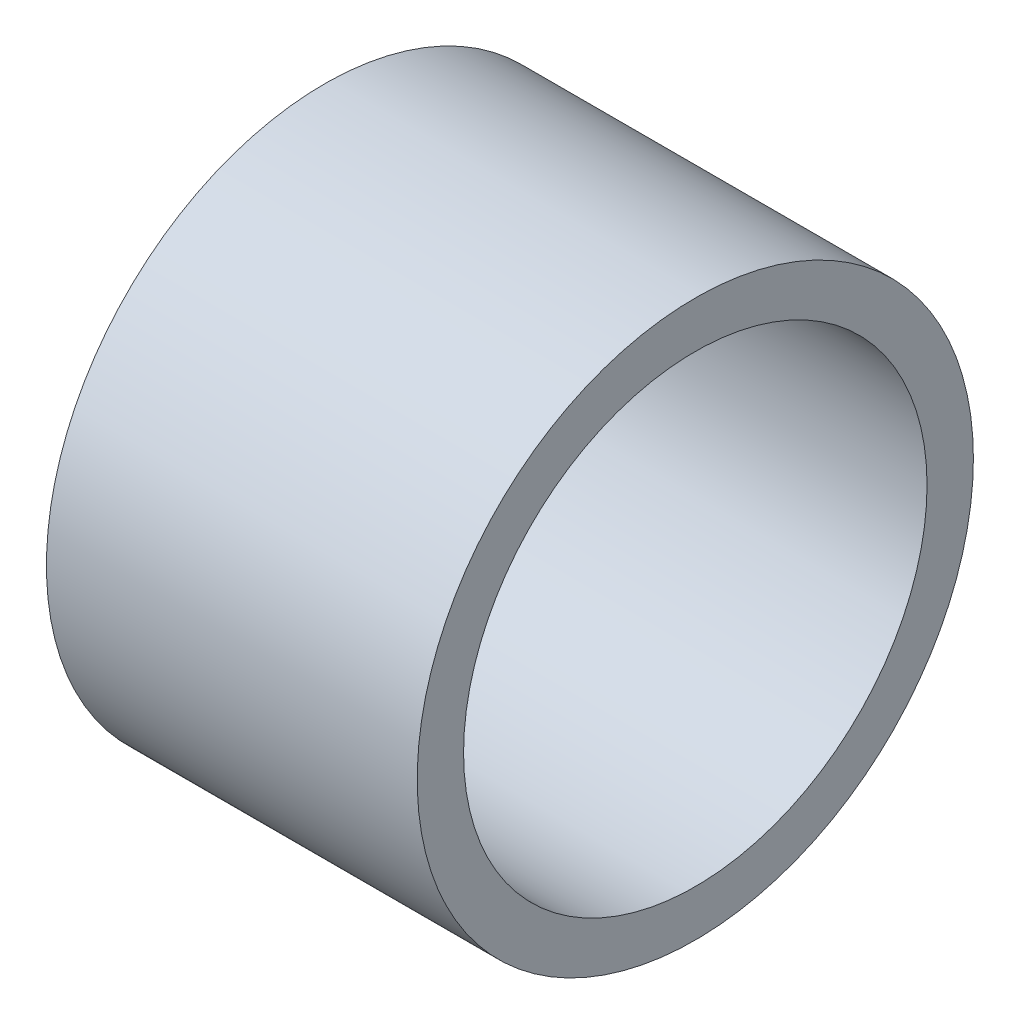
ISO-10303-21;
HEADER;
FILE_DESCRIPTION(('STEP AP214'),'2;1');
FILE_NAME('part.step','',(''),(''),'','','');
FILE_SCHEMA(('AUTOMOTIVE_DESIGN { 1 0 10303 214 1 1 1 1 }'));
ENDSEC;
DATA;
#1=APPLICATION_CONTEXT('core data for automotive mechanical design processes');
#2=APPLICATION_PROTOCOL_DEFINITION('international standard','automotive_design',2000,#1);
#3=PRODUCT_CONTEXT('',#1,'mechanical');
#4=PRODUCT('Part','Part','',(#3));
#5=PRODUCT_RELATED_PRODUCT_CATEGORY('part','',(#4));
#6=PRODUCT_DEFINITION_FORMATION('','',#4);
#7=PRODUCT_DEFINITION_CONTEXT('part definition',#1,'design');
#8=PRODUCT_DEFINITION('design','',#6,#7);
#9=PRODUCT_DEFINITION_SHAPE('','',#8);
#10=(LENGTH_UNIT() NAMED_UNIT(*) SI_UNIT(.MILLI.,.METRE.));
#11=(NAMED_UNIT(*) PLANE_ANGLE_UNIT() SI_UNIT($,.RADIAN.));
#12=(NAMED_UNIT(*) SI_UNIT($,.STERADIAN.) SOLID_ANGLE_UNIT());
#13=UNCERTAINTY_MEASURE_WITH_UNIT(LENGTH_MEASURE(1.E-05),#10,'distance_accuracy_value','');
#14=(GEOMETRIC_REPRESENTATION_CONTEXT(3) GLOBAL_UNCERTAINTY_ASSIGNED_CONTEXT((#13)) GLOBAL_UNIT_ASSIGNED_CONTEXT((#10,
#11,#12)) REPRESENTATION_CONTEXT('',''));
#15=CARTESIAN_POINT('',(0.,0.,0.));
#16=DIRECTION('',(0.,0.,1.));
#17=DIRECTION('',(1.,0.,0.));
#18=AXIS2_PLACEMENT_3D('',#15,#16,#17);
#19=CARTESIAN_POINT('',(20.,0.,0.));
#20=DIRECTION('',(-1.,0.,0.));
#21=DIRECTION('',(0.,0.,1.));
#22=AXIS2_PLACEMENT_3D('',#19,#20,#21);
#23=CYLINDRICAL_SURFACE('',#22,30.);
#24=CARTESIAN_POINT('',(20.,0.,0.));
#25=DIRECTION('',(1.,0.,0.));
#26=DIRECTION('',(0.,0.,-1.));
#27=AXIS2_PLACEMENT_3D('',#24,#25,#26);
#28=CIRCLE('',#27,30.);
#29=CARTESIAN_POINT('',(20.,0.,-30.));
#30=VERTEX_POINT('',#29);
#31=EDGE_CURVE('E10',#30,#30,#28,.T.);
#32=ORIENTED_EDGE('',*,*,#31,.F.);
#33=EDGE_LOOP('',(#32));
#34=FACE_BOUND('',#33,.T.);
#35=CARTESIAN_POINT('',(-20.,0.,0.));
#36=DIRECTION('',(1.,0.,0.));
#37=DIRECTION('',(0.,0.,-1.));
#38=AXIS2_PLACEMENT_3D('',#35,#36,#37);
#39=CIRCLE('',#38,30.);
#40=CARTESIAN_POINT('',(-20.,0.,-30.));
#41=VERTEX_POINT('',#40);
#42=EDGE_CURVE('E36',#41,#41,#39,.T.);
#43=ORIENTED_EDGE('',*,*,#42,.T.);
#44=EDGE_LOOP('',(#43));
#45=FACE_BOUND('',#44,.T.);
#46=ADVANCED_FACE('F33',(#34,#45),#23,.T.);
#47=CARTESIAN_POINT('',(20.,0.,0.));
#48=DIRECTION('',(1.,0.,0.));
#49=DIRECTION('',(0.,0.,-1.));
#50=AXIS2_PLACEMENT_3D('',#47,#48,#49);
#51=PLANE('',#50);
#52=CARTESIAN_POINT('',(20.,0.,0.));
#53=DIRECTION('',(1.,0.,0.));
#54=DIRECTION('',(0.,0.,-1.));
#55=AXIS2_PLACEMENT_3D('',#52,#53,#54);
#56=CIRCLE('',#55,25.);
#57=CARTESIAN_POINT('',(20.,0.,-25.));
#58=VERTEX_POINT('',#57);
#59=EDGE_CURVE('E45',#58,#58,#56,.T.);
#60=ORIENTED_EDGE('',*,*,#59,.F.);
#61=EDGE_LOOP('',(#60));
#62=FACE_BOUND('',#61,.T.);
#63=ORIENTED_EDGE('',*,*,#31,.T.);
#64=EDGE_LOOP('',(#63));
#65=FACE_BOUND('',#64,.T.);
#66=ADVANCED_FACE('F60',(#62,#65),#51,.T.);
#67=CARTESIAN_POINT('',(-20.,0.,0.));
#68=DIRECTION('',(1.,0.,0.));
#69=DIRECTION('',(0.,0.,-1.));
#70=AXIS2_PLACEMENT_3D('',#67,#68,#69);
#71=PLANE('',#70);
#72=CARTESIAN_POINT('',(-20.,0.,0.));
#73=DIRECTION('',(1.,0.,0.));
#74=DIRECTION('',(0.,0.,-1.));
#75=AXIS2_PLACEMENT_3D('',#72,#73,#74);
#76=CIRCLE('',#75,25.);
#77=CARTESIAN_POINT('',(-20.,0.,-25.));
#78=VERTEX_POINT('',#77);
#79=EDGE_CURVE('E43',#78,#78,#76,.T.);
#80=ORIENTED_EDGE('',*,*,#79,.T.);
#81=EDGE_LOOP('',(#80));
#82=FACE_BOUND('',#81,.T.);
#83=ORIENTED_EDGE('',*,*,#42,.F.);
#84=EDGE_LOOP('',(#83));
#85=FACE_BOUND('',#84,.T.);
#86=ADVANCED_FACE('F51',(#82,#85),#71,.F.);
#87=CARTESIAN_POINT('',(-20.,0.,0.));
#88=DIRECTION('',(1.,0.,0.));
#89=DIRECTION('',(0.,0.,-1.));
#90=AXIS2_PLACEMENT_3D('',#87,#88,#89);
#91=CYLINDRICAL_SURFACE('',#90,25.);
#92=ORIENTED_EDGE('',*,*,#79,.F.);
#93=EDGE_LOOP('',(#92));
#94=FACE_BOUND('',#93,.T.);
#95=ORIENTED_EDGE('',*,*,#59,.T.);
#96=EDGE_LOOP('',(#95));
#97=FACE_BOUND('',#96,.T.);
#98=ADVANCED_FACE('F54',(#94,#97),#91,.F.);
#99=CLOSED_SHELL('',(#46,#66,#86,#98));
#100=MANIFOLD_SOLID_BREP('B2',#99);
#101=ADVANCED_BREP_SHAPE_REPRESENTATION('',(#18,#100),#14);
#102=SHAPE_DEFINITION_REPRESENTATION(#9,#101);
ENDSEC;
END-ISO-10303-21;
